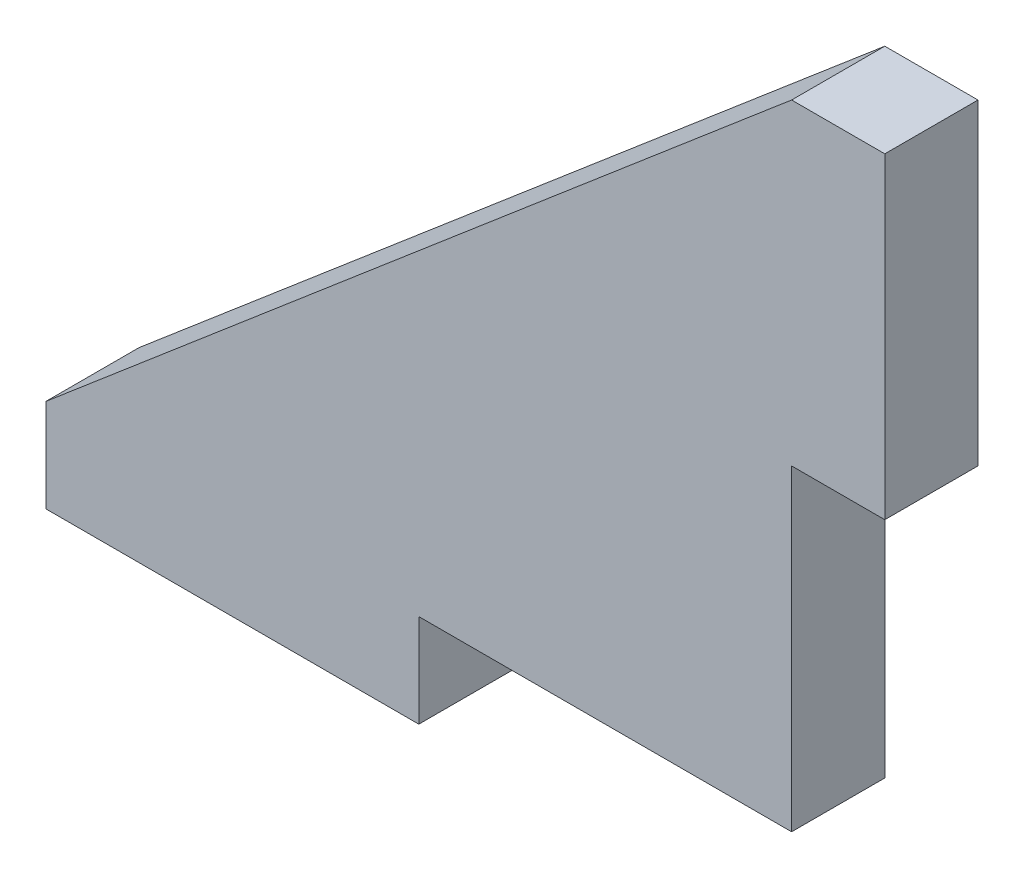
ISO-10303-21;
HEADER;
FILE_DESCRIPTION(('STEP AP214'),'2;1');
FILE_NAME('part.step','',(''),(''),'','','');
FILE_SCHEMA(('AUTOMOTIVE_DESIGN { 1 0 10303 214 1 1 1 1 }'));
ENDSEC;
DATA;
#1=APPLICATION_CONTEXT('core data for automotive mechanical design processes');
#2=APPLICATION_PROTOCOL_DEFINITION('international standard','automotive_design',2000,#1);
#3=PRODUCT_CONTEXT('',#1,'mechanical');
#4=PRODUCT('Part','Part','',(#3));
#5=PRODUCT_RELATED_PRODUCT_CATEGORY('part','',(#4));
#6=PRODUCT_DEFINITION_FORMATION('','',#4);
#7=PRODUCT_DEFINITION_CONTEXT('part definition',#1,'design');
#8=PRODUCT_DEFINITION('design','',#6,#7);
#9=PRODUCT_DEFINITION_SHAPE('','',#8);
#10=(LENGTH_UNIT() NAMED_UNIT(*) SI_UNIT(.MILLI.,.METRE.));
#11=(NAMED_UNIT(*) PLANE_ANGLE_UNIT() SI_UNIT($,.RADIAN.));
#12=(NAMED_UNIT(*) SI_UNIT($,.STERADIAN.) SOLID_ANGLE_UNIT());
#13=UNCERTAINTY_MEASURE_WITH_UNIT(LENGTH_MEASURE(1.E-05),#10,'distance_accuracy_value','');
#14=(GEOMETRIC_REPRESENTATION_CONTEXT(3) GLOBAL_UNCERTAINTY_ASSIGNED_CONTEXT((#13)) GLOBAL_UNIT_ASSIGNED_CONTEXT((#10,
#11,#12)) REPRESENTATION_CONTEXT('',''));
#15=CARTESIAN_POINT('',(0.,0.,0.));
#16=DIRECTION('',(0.,0.,1.));
#17=DIRECTION('',(1.,0.,0.));
#18=AXIS2_PLACEMENT_3D('',#15,#16,#17);
#19=CARTESIAN_POINT('',(45.,0.,5.));
#20=DIRECTION('',(1.,0.,0.));
#21=DIRECTION('',(0.,0.,-1.));
#22=AXIS2_PLACEMENT_3D('',#19,#20,#21);
#23=PLANE('',#22);
#24=DIRECTION('',(0.,-1.,0.));
#25=VECTOR('',#24,1.);
#26=CARTESIAN_POINT('',(45.,0.,0.));
#27=LINE('',#26,#25);
#28=CARTESIAN_POINT('',(45.,34.,0.));
#29=VERTEX_POINT('',#28);
#30=CARTESIAN_POINT('',(45.,17.,0.));
#31=VERTEX_POINT('',#30);
#32=EDGE_CURVE('E133',#29,#31,#27,.T.);
#33=ORIENTED_EDGE('',*,*,#32,.F.);
#34=DIRECTION('',(0.,0.,-1.));
#35=VECTOR('',#34,1.);
#36=CARTESIAN_POINT('',(45.,34.,5.));
#37=LINE('',#36,#35);
#38=CARTESIAN_POINT('',(45.,34.,5.));
#39=VERTEX_POINT('',#38);
#40=EDGE_CURVE('E11',#39,#29,#37,.T.);
#41=ORIENTED_EDGE('',*,*,#40,.F.);
#42=DIRECTION('',(0.,-1.,0.));
#43=VECTOR('',#42,1.);
#44=CARTESIAN_POINT('',(45.,0.,5.));
#45=LINE('',#44,#43);
#46=CARTESIAN_POINT('',(45.,17.,5.));
#47=VERTEX_POINT('',#46);
#48=EDGE_CURVE('E155',#39,#47,#45,.T.);
#49=ORIENTED_EDGE('',*,*,#48,.T.);
#50=DIRECTION('',(0.,0.,-1.));
#51=VECTOR('',#50,1.);
#52=CARTESIAN_POINT('',(45.,17.,5.));
#53=LINE('',#52,#51);
#54=EDGE_CURVE('E88',#47,#31,#53,.T.);
#55=ORIENTED_EDGE('',*,*,#54,.T.);
#56=EDGE_LOOP('',(#33,#41,#49,#55));
#57=FACE_BOUND('',#56,.T.);
#58=ADVANCED_FACE('F35',(#57),#23,.T.);
#59=CARTESIAN_POINT('',(0.,34.,5.));
#60=DIRECTION('',(0.,1.,0.));
#61=DIRECTION('',(-1.,0.,0.));
#62=AXIS2_PLACEMENT_3D('',#59,#60,#61);
#63=PLANE('',#62);
#64=DIRECTION('',(1.,0.,0.));
#65=VECTOR('',#64,1.);
#66=CARTESIAN_POINT('',(0.,34.,0.));
#67=LINE('',#66,#65);
#68=CARTESIAN_POINT('',(40.,34.,0.));
#69=VERTEX_POINT('',#68);
#70=EDGE_CURVE('E136',#69,#29,#67,.T.);
#71=ORIENTED_EDGE('',*,*,#70,.F.);
#72=DIRECTION('',(0.,0.,-1.));
#73=VECTOR('',#72,1.);
#74=CARTESIAN_POINT('',(40.,34.,5.));
#75=LINE('',#74,#73);
#76=CARTESIAN_POINT('',(40.,34.,5.));
#77=VERTEX_POINT('',#76);
#78=EDGE_CURVE('E43',#77,#69,#75,.T.);
#79=ORIENTED_EDGE('',*,*,#78,.F.);
#80=DIRECTION('',(1.,0.,0.));
#81=VECTOR('',#80,1.);
#82=CARTESIAN_POINT('',(0.,34.,5.));
#83=LINE('',#82,#81);
#84=EDGE_CURVE('E194',#77,#39,#83,.T.);
#85=ORIENTED_EDGE('',*,*,#84,.T.);
#86=ORIENTED_EDGE('',*,*,#40,.T.);
#87=EDGE_LOOP('',(#71,#79,#85,#86));
#88=FACE_BOUND('',#87,.T.);
#89=ADVANCED_FACE('F175',(#88),#63,.T.);
#90=CARTESIAN_POINT('',(0.,0.,5.));
#91=DIRECTION('',(-0.647648420095541,0.761939317759459,0.));
#92=DIRECTION('',(-0.761939317759459,-0.647648420095541,0.));
#93=AXIS2_PLACEMENT_3D('',#90,#91,#92);
#94=PLANE('',#93);
#95=DIRECTION('',(0.761939317759459,0.647648420095541,0.));
#96=VECTOR('',#95,1.);
#97=CARTESIAN_POINT('',(0.,0.,0.));
#98=LINE('',#97,#96);
#99=CARTESIAN_POINT('',(0.,0.,0.));
#100=VERTEX_POINT('',#99);
#101=EDGE_CURVE('E139',#100,#69,#98,.T.);
#102=ORIENTED_EDGE('',*,*,#101,.F.);
#103=DIRECTION('',(0.,0.,-1.));
#104=VECTOR('',#103,1.);
#105=CARTESIAN_POINT('',(0.,0.,5.));
#106=LINE('',#105,#104);
#107=CARTESIAN_POINT('',(0.,0.,5.));
#108=VERTEX_POINT('',#107);
#109=EDGE_CURVE('E164',#108,#100,#106,.T.);
#110=ORIENTED_EDGE('',*,*,#109,.F.);
#111=DIRECTION('',(0.761939317759459,0.647648420095541,0.));
#112=VECTOR('',#111,1.);
#113=CARTESIAN_POINT('',(0.,0.,5.));
#114=LINE('',#113,#112);
#115=EDGE_CURVE('E171',#108,#77,#114,.T.);
#116=ORIENTED_EDGE('',*,*,#115,.T.);
#117=ORIENTED_EDGE('',*,*,#78,.T.);
#118=EDGE_LOOP('',(#102,#110,#116,#117));
#119=FACE_BOUND('',#118,.T.);
#120=ADVANCED_FACE('F169',(#119),#94,.T.);
#121=CARTESIAN_POINT('',(0.,0.,5.));
#122=DIRECTION('',(1.,0.,0.));
#123=DIRECTION('',(0.,1.,0.));
#124=AXIS2_PLACEMENT_3D('',#121,#122,#123);
#125=PLANE('',#124);
#126=DIRECTION('',(0.,-1.,0.));
#127=VECTOR('',#126,1.);
#128=CARTESIAN_POINT('',(0.,0.,0.));
#129=LINE('',#128,#127);
#130=CARTESIAN_POINT('',(0.,-5.00000000000001,0.));
#131=VERTEX_POINT('',#130);
#132=EDGE_CURVE('E142',#100,#131,#129,.T.);
#133=ORIENTED_EDGE('',*,*,#132,.T.);
#134=DIRECTION('',(0.,0.,-1.));
#135=VECTOR('',#134,1.);
#136=CARTESIAN_POINT('',(0.,-5.00000000000001,5.));
#137=LINE('',#136,#135);
#138=CARTESIAN_POINT('',(0.,-5.00000000000001,5.));
#139=VERTEX_POINT('',#138);
#140=EDGE_CURVE('E161',#139,#131,#137,.T.);
#141=ORIENTED_EDGE('',*,*,#140,.F.);
#142=DIRECTION('',(0.,-1.,0.));
#143=VECTOR('',#142,1.);
#144=CARTESIAN_POINT('',(0.,0.,5.));
#145=LINE('',#144,#143);
#146=EDGE_CURVE('E189',#108,#139,#145,.T.);
#147=ORIENTED_EDGE('',*,*,#146,.F.);
#148=ORIENTED_EDGE('',*,*,#109,.T.);
#149=EDGE_LOOP('',(#133,#141,#147,#148));
#150=FACE_BOUND('',#149,.T.);
#151=ADVANCED_FACE('F182',(#150),#125,.F.);
#152=CARTESIAN_POINT('',(0.,-5.00000000000001,5.));
#153=DIRECTION('',(0.,1.,0.));
#154=DIRECTION('',(0.,0.,1.));
#155=AXIS2_PLACEMENT_3D('',#152,#153,#154);
#156=PLANE('',#155);
#157=DIRECTION('',(1.,0.,0.));
#158=VECTOR('',#157,1.);
#159=CARTESIAN_POINT('',(0.,-5.00000000000001,0.));
#160=LINE('',#159,#158);
#161=CARTESIAN_POINT('',(20.,-5.00000000000001,0.));
#162=VERTEX_POINT('',#161);
#163=EDGE_CURVE('E144',#131,#162,#160,.T.);
#164=ORIENTED_EDGE('',*,*,#163,.T.);
#165=DIRECTION('',(0.,0.,-1.));
#166=VECTOR('',#165,1.);
#167=CARTESIAN_POINT('',(20.,-5.00000000000001,5.));
#168=LINE('',#167,#166);
#169=CARTESIAN_POINT('',(20.,-5.00000000000001,5.));
#170=VERTEX_POINT('',#169);
#171=EDGE_CURVE('E159',#170,#162,#168,.T.);
#172=ORIENTED_EDGE('',*,*,#171,.F.);
#173=DIRECTION('',(1.,0.,0.));
#174=VECTOR('',#173,1.);
#175=CARTESIAN_POINT('',(0.,-5.00000000000001,5.));
#176=LINE('',#175,#174);
#177=EDGE_CURVE('E188',#139,#170,#176,.T.);
#178=ORIENTED_EDGE('',*,*,#177,.F.);
#179=ORIENTED_EDGE('',*,*,#140,.T.);
#180=EDGE_LOOP('',(#164,#172,#178,#179));
#181=FACE_BOUND('',#180,.T.);
#182=ADVANCED_FACE('F186',(#181),#156,.F.);
#183=CARTESIAN_POINT('',(20.,0.,5.));
#184=DIRECTION('',(1.,0.,0.));
#185=DIRECTION('',(0.,0.,-1.));
#186=AXIS2_PLACEMENT_3D('',#183,#184,#185);
#187=PLANE('',#186);
#188=DIRECTION('',(0.,-1.,0.));
#189=VECTOR('',#188,1.);
#190=CARTESIAN_POINT('',(20.,0.,0.));
#191=LINE('',#190,#189);
#192=CARTESIAN_POINT('',(20.,0.,0.));
#193=VERTEX_POINT('',#192);
#194=EDGE_CURVE('E147',#193,#162,#191,.T.);
#195=ORIENTED_EDGE('',*,*,#194,.F.);
#196=DIRECTION('',(0.,0.,-1.));
#197=VECTOR('',#196,1.);
#198=CARTESIAN_POINT('',(20.,0.,5.));
#199=LINE('',#198,#197);
#200=CARTESIAN_POINT('',(20.,0.,5.));
#201=VERTEX_POINT('',#200);
#202=EDGE_CURVE('E120',#201,#193,#199,.T.);
#203=ORIENTED_EDGE('',*,*,#202,.F.);
#204=DIRECTION('',(0.,-1.,0.));
#205=VECTOR('',#204,1.);
#206=CARTESIAN_POINT('',(20.,0.,5.));
#207=LINE('',#206,#205);
#208=EDGE_CURVE('E126',#201,#170,#207,.T.);
#209=ORIENTED_EDGE('',*,*,#208,.T.);
#210=ORIENTED_EDGE('',*,*,#171,.T.);
#211=EDGE_LOOP('',(#195,#203,#209,#210));
#212=FACE_BOUND('',#211,.T.);
#213=ADVANCED_FACE('F209',(#212),#187,.T.);
#214=CARTESIAN_POINT('',(0.,0.,5.));
#215=DIRECTION('',(0.,-1.,0.));
#216=DIRECTION('',(1.,0.,0.));
#217=AXIS2_PLACEMENT_3D('',#214,#215,#216);
#218=PLANE('',#217);
#219=DIRECTION('',(-1.,0.,0.));
#220=VECTOR('',#219,1.);
#221=CARTESIAN_POINT('',(0.,0.,0.));
#222=LINE('',#221,#220);
#223=CARTESIAN_POINT('',(40.,0.,0.));
#224=VERTEX_POINT('',#223);
#225=EDGE_CURVE('E115',#224,#193,#222,.T.);
#226=ORIENTED_EDGE('',*,*,#225,.F.);
#227=DIRECTION('',(0.,0.,-1.));
#228=VECTOR('',#227,1.);
#229=CARTESIAN_POINT('',(40.,0.,5.));
#230=LINE('',#229,#228);
#231=CARTESIAN_POINT('',(40.,0.,5.));
#232=VERTEX_POINT('',#231);
#233=EDGE_CURVE('E110',#232,#224,#230,.T.);
#234=ORIENTED_EDGE('',*,*,#233,.F.);
#235=DIRECTION('',(-1.,0.,0.));
#236=VECTOR('',#235,1.);
#237=CARTESIAN_POINT('',(0.,0.,5.));
#238=LINE('',#237,#236);
#239=EDGE_CURVE('E113',#232,#201,#238,.T.);
#240=ORIENTED_EDGE('',*,*,#239,.T.);
#241=ORIENTED_EDGE('',*,*,#202,.T.);
#242=EDGE_LOOP('',(#226,#234,#240,#241));
#243=FACE_BOUND('',#242,.T.);
#244=ADVANCED_FACE('F112',(#243),#218,.T.);
#245=CARTESIAN_POINT('',(40.,0.,5.));
#246=DIRECTION('',(1.,0.,0.));
#247=DIRECTION('',(0.,1.,0.));
#248=AXIS2_PLACEMENT_3D('',#245,#246,#247);
#249=PLANE('',#248);
#250=DIRECTION('',(0.,-1.,0.));
#251=VECTOR('',#250,1.);
#252=CARTESIAN_POINT('',(40.,0.,0.));
#253=LINE('',#252,#251);
#254=CARTESIAN_POINT('',(40.,17.,0.));
#255=VERTEX_POINT('',#254);
#256=EDGE_CURVE('E151',#255,#224,#253,.T.);
#257=ORIENTED_EDGE('',*,*,#256,.F.);
#258=DIRECTION('',(0.,0.,-1.));
#259=VECTOR('',#258,1.);
#260=CARTESIAN_POINT('',(40.,17.,5.));
#261=LINE('',#260,#259);
#262=CARTESIAN_POINT('',(40.,17.,5.));
#263=VERTEX_POINT('',#262);
#264=EDGE_CURVE('E81',#263,#255,#261,.T.);
#265=ORIENTED_EDGE('',*,*,#264,.F.);
#266=DIRECTION('',(0.,-1.,0.));
#267=VECTOR('',#266,1.);
#268=CARTESIAN_POINT('',(40.,0.,5.));
#269=LINE('',#268,#267);
#270=EDGE_CURVE('E124',#263,#232,#269,.T.);
#271=ORIENTED_EDGE('',*,*,#270,.T.);
#272=ORIENTED_EDGE('',*,*,#233,.T.);
#273=EDGE_LOOP('',(#257,#265,#271,#272));
#274=FACE_BOUND('',#273,.T.);
#275=ADVANCED_FACE('F128',(#274),#249,.T.);
#276=CARTESIAN_POINT('',(0.,17.,5.));
#277=DIRECTION('',(0.,1.,0.));
#278=DIRECTION('',(0.,0.,1.));
#279=AXIS2_PLACEMENT_3D('',#276,#277,#278);
#280=PLANE('',#279);
#281=DIRECTION('',(1.,0.,0.));
#282=VECTOR('',#281,1.);
#283=CARTESIAN_POINT('',(0.,17.,0.));
#284=LINE('',#283,#282);
#285=EDGE_CURVE('E153',#255,#31,#284,.T.);
#286=ORIENTED_EDGE('',*,*,#285,.T.);
#287=ORIENTED_EDGE('',*,*,#54,.F.);
#288=DIRECTION('',(1.,0.,0.));
#289=VECTOR('',#288,1.);
#290=CARTESIAN_POINT('',(0.,17.,5.));
#291=LINE('',#290,#289);
#292=EDGE_CURVE('E51',#263,#47,#291,.T.);
#293=ORIENTED_EDGE('',*,*,#292,.F.);
#294=ORIENTED_EDGE('',*,*,#264,.T.);
#295=EDGE_LOOP('',(#286,#287,#293,#294));
#296=FACE_BOUND('',#295,.T.);
#297=ADVANCED_FACE('F217',(#296),#280,.F.);
#298=CARTESIAN_POINT('',(0.,0.,5.));
#299=DIRECTION('',(0.,0.,1.));
#300=DIRECTION('',(1.,0.,0.));
#301=AXIS2_PLACEMENT_3D('',#298,#299,#300);
#302=PLANE('',#301);
#303=ORIENTED_EDGE('',*,*,#48,.F.);
#304=ORIENTED_EDGE('',*,*,#84,.F.);
#305=ORIENTED_EDGE('',*,*,#115,.F.);
#306=ORIENTED_EDGE('',*,*,#146,.T.);
#307=ORIENTED_EDGE('',*,*,#177,.T.);
#308=ORIENTED_EDGE('',*,*,#208,.F.);
#309=ORIENTED_EDGE('',*,*,#239,.F.);
#310=ORIENTED_EDGE('',*,*,#270,.F.);
#311=ORIENTED_EDGE('',*,*,#292,.T.);
#312=EDGE_LOOP('',(#303,#304,#305,#306,#307,#308,#309,#310,#311));
#313=FACE_BOUND('',#312,.T.);
#314=ADVANCED_FACE('F123',(#313),#302,.T.);
#315=CARTESIAN_POINT('',(0.,0.,0.));
#316=DIRECTION('',(0.,0.,1.));
#317=DIRECTION('',(1.,0.,0.));
#318=AXIS2_PLACEMENT_3D('',#315,#316,#317);
#319=PLANE('',#318);
#320=ORIENTED_EDGE('',*,*,#32,.T.);
#321=ORIENTED_EDGE('',*,*,#285,.F.);
#322=ORIENTED_EDGE('',*,*,#256,.T.);
#323=ORIENTED_EDGE('',*,*,#225,.T.);
#324=ORIENTED_EDGE('',*,*,#194,.T.);
#325=ORIENTED_EDGE('',*,*,#163,.F.);
#326=ORIENTED_EDGE('',*,*,#132,.F.);
#327=ORIENTED_EDGE('',*,*,#101,.T.);
#328=ORIENTED_EDGE('',*,*,#70,.T.);
#329=EDGE_LOOP('',(#320,#321,#322,#323,#324,#325,#326,#327,#328));
#330=FACE_BOUND('',#329,.T.);
#331=ADVANCED_FACE('F178',(#330),#319,.F.);
#332=CLOSED_SHELL('',(#58,#89,#120,#151,#182,#213,#244,#275,#297,#314,#331));
#333=MANIFOLD_SOLID_BREP('B2',#332);
#334=ADVANCED_BREP_SHAPE_REPRESENTATION('',(#18,#333),#14);
#335=SHAPE_DEFINITION_REPRESENTATION(#9,#334);
ENDSEC;
END-ISO-10303-21;
